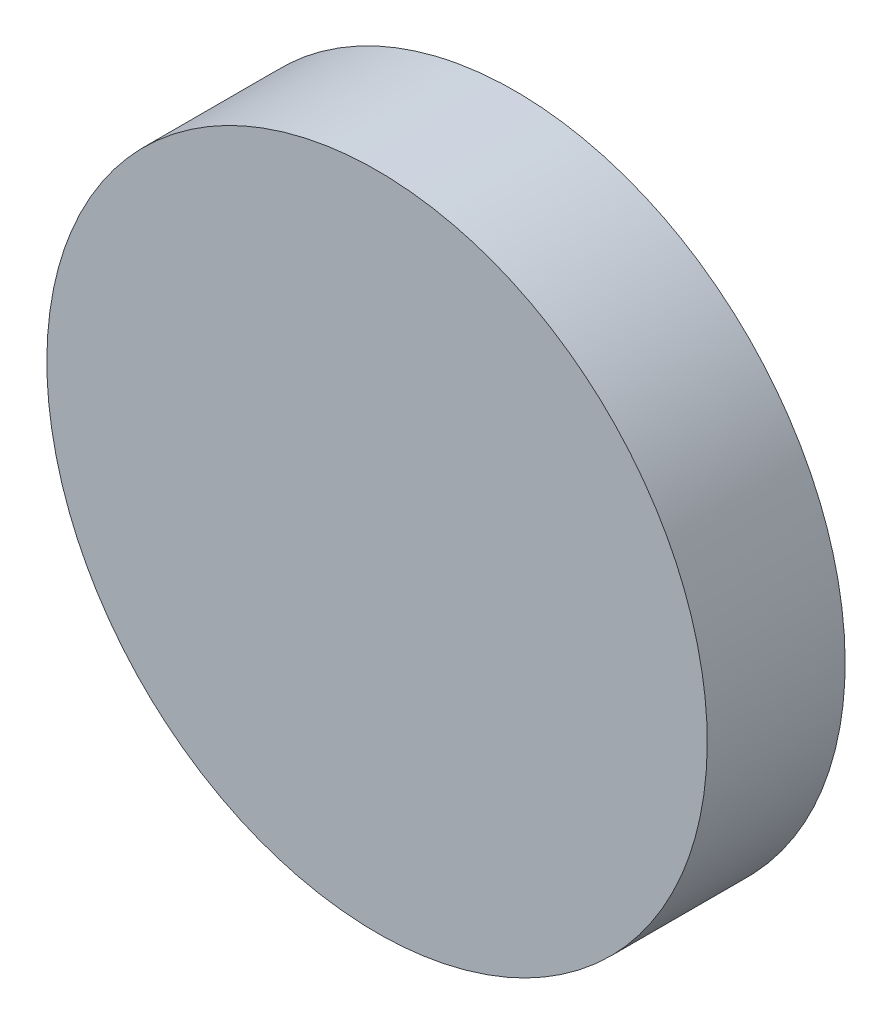
ISO-10303-21;
HEADER;
FILE_DESCRIPTION(('STEP AP214'),'2;1');
FILE_NAME('part.step','',(''),(''),'','','');
FILE_SCHEMA(('AUTOMOTIVE_DESIGN { 1 0 10303 214 1 1 1 1 }'));
ENDSEC;
DATA;
#1=APPLICATION_CONTEXT('core data for automotive mechanical design processes');
#2=APPLICATION_PROTOCOL_DEFINITION('international standard','automotive_design',2000,#1);
#3=PRODUCT_CONTEXT('',#1,'mechanical');
#4=PRODUCT('Part','Part','',(#3));
#5=PRODUCT_RELATED_PRODUCT_CATEGORY('part','',(#4));
#6=PRODUCT_DEFINITION_FORMATION('','',#4);
#7=PRODUCT_DEFINITION_CONTEXT('part definition',#1,'design');
#8=PRODUCT_DEFINITION('design','',#6,#7);
#9=PRODUCT_DEFINITION_SHAPE('','',#8);
#10=(LENGTH_UNIT() NAMED_UNIT(*) SI_UNIT(.MILLI.,.METRE.));
#11=(NAMED_UNIT(*) PLANE_ANGLE_UNIT() SI_UNIT($,.RADIAN.));
#12=(NAMED_UNIT(*) SI_UNIT($,.STERADIAN.) SOLID_ANGLE_UNIT());
#13=UNCERTAINTY_MEASURE_WITH_UNIT(LENGTH_MEASURE(1.E-05),#10,'distance_accuracy_value','');
#14=(GEOMETRIC_REPRESENTATION_CONTEXT(3) GLOBAL_UNCERTAINTY_ASSIGNED_CONTEXT((#13)) GLOBAL_UNIT_ASSIGNED_CONTEXT((#10,
#11,#12)) REPRESENTATION_CONTEXT('',''));
#15=CARTESIAN_POINT('',(0.,0.,0.));
#16=DIRECTION('',(0.,0.,1.));
#17=DIRECTION('',(1.,0.,0.));
#18=AXIS2_PLACEMENT_3D('',#15,#16,#17);
#19=CARTESIAN_POINT('',(4.40615937956644,-7.85,-7.2343687668426));
#20=CARTESIAN_POINT('',(4.40615937956644,-7.64139482578253,-7.2343687668426));
#21=CARTESIAN_POINT('',(4.48914767766892,-7.22418447734758,-7.2343687668426));
#22=CARTESIAN_POINT('',(4.84364369498715,-6.69364369498715,-7.2343687668426));
#23=CARTESIAN_POINT('',(5.37418447734758,-6.33914767766892,-7.2343687668426));
#24=CARTESIAN_POINT('',(6.,-6.21466523051519,-7.2343687668426));
#25=CARTESIAN_POINT('',(6.62581552265242,-6.33914767766892,-7.2343687668426));
#26=CARTESIAN_POINT('',(7.15635630501285,-6.69364369498715,-7.2343687668426));
#27=CARTESIAN_POINT('',(7.51085232233108,-7.22418447734758,-7.2343687668426));
#28=CARTESIAN_POINT('',(7.63533476948481,-7.85,-7.2343687668426));
#29=CARTESIAN_POINT('',(7.51085232233108,-8.47581552265242,-7.2343687668426));
#30=CARTESIAN_POINT('',(7.15635630501285,-9.00635630501285,-7.2343687668426));
#31=CARTESIAN_POINT('',(6.62581552265242,-9.36085232233108,-7.2343687668426));
#32=CARTESIAN_POINT('',(6.,-9.48533476948481,-7.2343687668426));
#33=CARTESIAN_POINT('',(5.37418447734758,-9.36085232233108,-7.2343687668426));
#34=CARTESIAN_POINT('',(4.84364369498715,-9.00635630501285,-7.2343687668426));
#35=CARTESIAN_POINT('',(4.48914767766892,-8.47581552265242,-7.2343687668426));
#36=CARTESIAN_POINT('',(4.40615937956644,-8.05860517421747,-7.2343687668426));
#37=CARTESIAN_POINT('',(4.40615937956644,-7.85,-7.2343687668426));
#38=B_SPLINE_CURVE_WITH_KNOTS('',3,(#19,#20,#21,#22,#23,#24,#25,#26,#27,#28,#29,#30,#31,#32,#33,
#34,#35,#36,#37),.UNSPECIFIED.,.T.,.F.,(4,1,1,1,1,1,1,1,1,1,1,1,1,1,1,1,4),(0.,0.0625,0.125,
0.1875,0.25,0.3125,0.375,0.4375,0.5,0.5625,0.625,0.6875,0.75,0.8125,0.875,0.9375,1.),.UNSPECIFIED.);
#39=DIRECTION('',(0.,0.,-1.));
#40=VECTOR('',#39,1.);
#41=SURFACE_OF_LINEAR_EXTRUSION('',#38,#40);
#42=CARTESIAN_POINT('',(4.40615937956644,-7.85,-7.2343687668426));
#43=CARTESIAN_POINT('',(4.40615937956644,-7.64139482578253,-7.2343687668426));
#44=CARTESIAN_POINT('',(4.48914767766892,-7.22418447734758,-7.2343687668426));
#45=CARTESIAN_POINT('',(4.84364369498715,-6.69364369498715,-7.2343687668426));
#46=CARTESIAN_POINT('',(5.37418447734758,-6.33914767766892,-7.2343687668426));
#47=CARTESIAN_POINT('',(6.,-6.21466523051519,-7.2343687668426));
#48=CARTESIAN_POINT('',(6.62581552265242,-6.33914767766892,-7.2343687668426));
#49=CARTESIAN_POINT('',(7.15635630501285,-6.69364369498715,-7.2343687668426));
#50=CARTESIAN_POINT('',(7.51085232233108,-7.22418447734758,-7.2343687668426));
#51=CARTESIAN_POINT('',(7.63533476948481,-7.85,-7.2343687668426));
#52=CARTESIAN_POINT('',(7.51085232233108,-8.47581552265242,-7.2343687668426));
#53=CARTESIAN_POINT('',(7.15635630501285,-9.00635630501285,-7.2343687668426));
#54=CARTESIAN_POINT('',(6.62581552265242,-9.36085232233108,-7.2343687668426));
#55=CARTESIAN_POINT('',(6.,-9.48533476948481,-7.2343687668426));
#56=CARTESIAN_POINT('',(5.37418447734758,-9.36085232233108,-7.2343687668426));
#57=CARTESIAN_POINT('',(4.84364369498715,-9.00635630501285,-7.2343687668426));
#58=CARTESIAN_POINT('',(4.48914767766892,-8.47581552265242,-7.2343687668426));
#59=CARTESIAN_POINT('',(4.40615937956644,-8.05860517421747,-7.2343687668426));
#60=CARTESIAN_POINT('',(4.40615937956644,-7.85,-7.2343687668426));
#61=B_SPLINE_CURVE_WITH_KNOTS('',3,(#42,#43,#44,#45,#46,#47,#48,#49,#50,#51,#52,#53,#54,#55,#56,
#57,#58,#59,#60),.UNSPECIFIED.,.T.,.F.,(4,1,1,1,1,1,1,1,1,1,1,1,1,1,1,1,4),(0.,0.0625,0.125,
0.1875,0.25,0.3125,0.375,0.4375,0.5,0.5625,0.625,0.6875,0.75,0.8125,0.875,0.9375,1.),.UNSPECIFIED.);
#62=CARTESIAN_POINT('',(4.40615937956644,-7.85,-7.2343687668426));
#63=VERTEX_POINT('',#62);
#64=EDGE_CURVE('E9',#63,#63,#61,.T.);
#65=ORIENTED_EDGE('',*,*,#64,.T.);
#66=EDGE_LOOP('',(#65));
#67=FACE_BOUND('',#66,.T.);
#68=CARTESIAN_POINT('',(4.40615937956644,-7.85,-7.9));
#69=CARTESIAN_POINT('',(4.40615936068841,-7.87607626205079,-7.9));
#70=CARTESIAN_POINT('',(4.40680775398327,-7.90215198285669,-7.9));
#71=CARTESIAN_POINT('',(4.40938881944497,-7.9542414022198,-7.9));
#72=CARTESIAN_POINT('',(4.41132156716732,-7.9802550970378,-7.9));
#73=CARTESIAN_POINT('',(4.41645896933017,-8.03215822267473,-7.9));
#74=CARTESIAN_POINT('',(4.41966371105239,-8.0580476448429,-7.9));
#75=CARTESIAN_POINT('',(4.42733277299065,-8.10964035851338,-7.9));
#76=CARTESIAN_POINT('',(4.43179714753067,-8.13534364193907,-7.9));
#77=CARTESIAN_POINT('',(4.44197319667312,-8.18650209986784,-7.9));
#78=CARTESIAN_POINT('',(4.44768487127555,-8.21195727437092,-7.9));
#79=CARTESIAN_POINT('',(4.46034326399522,-8.26255755947254,-7.9));
#80=CARTESIAN_POINT('',(4.46728992883248,-8.28770268339727,-7.9));
#81=CARTESIAN_POINT('',(4.48240603470013,-8.33762087734628,-7.9));
#82=CARTESIAN_POINT('',(4.49057539178457,-8.3623939727844,-7.9));
#83=CARTESIAN_POINT('',(4.50812462946405,-8.41150620297505,-7.9));
#84=CARTESIAN_POINT('',(4.51750443881648,-8.43584536317147,-7.9));
#85=CARTESIAN_POINT('',(4.5374621065762,-8.48402743536936,-7.9));
#86=CARTESIAN_POINT('',(4.5480399649835,-8.50787034737083,-7.9));
#87=CARTESIAN_POINT('',(4.57035837106943,-8.55500712338237,-7.9));
#88=CARTESIAN_POINT('',(4.58209898711576,-8.57830095500787,-7.9));
#89=CARTESIAN_POINT('',(4.606707779424,-8.62428714926546,-7.9));
#90=CARTESIAN_POINT('',(4.61957603301496,-8.64697947050907,-7.9));
#91=CARTESIAN_POINT('',(4.64640500305672,-8.69171011113872,-7.9));
#92=CARTESIAN_POINT('',(4.66036576660523,-8.71374840227321,-7.9));
#93=CARTESIAN_POINT('',(4.68934470335113,-8.75711844600313,-7.9));
#94=CARTESIAN_POINT('',(4.70436287654851,-8.77845019859857,-7.9));
#95=CARTESIAN_POINT('',(4.73542159756027,-8.82035460998663,-7.9));
#96=CARTESIAN_POINT('',(4.75146210125009,-8.84092730148047,-7.9));
#97=CARTESIAN_POINT('',(4.78453042779475,-8.8812610156734,-7.9));
#98=CARTESIAN_POINT('',(4.80155818281909,-8.90102209397652,-7.9));
#99=CARTESIAN_POINT('',(4.83656600116306,-8.93968007579376,-7.9));
#100=CARTESIAN_POINT('',(4.85454600840006,-8.95857703007835,-7.9));
#101=CARTESIAN_POINT('',(4.89142296992165,-8.99545399159994,-7.9));
#102=CARTESIAN_POINT('',(4.91031992420624,-9.01343399883694,-7.9));
#103=CARTESIAN_POINT('',(4.94897790602348,-9.04844181718091,-7.9));
#104=CARTESIAN_POINT('',(4.96873898432661,-9.06546957220525,-7.9));
#105=CARTESIAN_POINT('',(5.00907269851952,-9.09853789874991,-7.9));
#106=CARTESIAN_POINT('',(5.02964539001336,-9.11457840243973,-7.9));
#107=CARTESIAN_POINT('',(5.07154980140144,-9.14563712345149,-7.9));
#108=CARTESIAN_POINT('',(5.09288155399691,-9.16065529664887,-7.9));
#109=CARTESIAN_POINT('',(5.13625159772675,-9.18963423339477,-7.9));
#110=CARTESIAN_POINT('',(5.15828988886112,-9.20359499694329,-7.9));
#111=CARTESIAN_POINT('',(5.20302052949109,-9.23042396698503,-7.9));
#112=CARTESIAN_POINT('',(5.22571285073514,-9.24329222057596,-7.9));
#113=CARTESIAN_POINT('',(5.27169904499153,-9.26790101288428,-7.9));
#114=CARTESIAN_POINT('',(5.2949928766154,-9.27964162893071,-7.9));
#115=CARTESIAN_POINT('',(5.3421296526314,-9.30196003501637,-7.9));
#116=CARTESIAN_POINT('',(5.36597256463894,-9.3125378934233,-7.9));
#117=CARTESIAN_POINT('',(5.41415463682022,-9.33249556118402,-7.9));
#118=CARTESIAN_POINT('',(5.43849379699396,-9.34187537053782,-7.9));
#119=CARTESIAN_POINT('',(5.48760602724659,-9.35942460821356,-7.9));
#120=CARTESIAN_POINT('',(5.51237912276938,-9.36759396529288,-7.9));
#121=CARTESIAN_POINT('',(5.56229731648706,-9.38271007117451,-7.9));
#122=CARTESIAN_POINT('',(5.58744244009577,-9.38965673603087,-7.9));
#123=CARTESIAN_POINT('',(5.6380427260608,-9.40231512869838,-7.9));
#124=CARTESIAN_POINT('',(5.66349790174338,-9.40802680322955,-7.9));
#125=CARTESIAN_POINT('',(5.71465635644971,-9.41820285256667,-7.9));
#126=CARTESIAN_POINT('',(5.74035963547346,-9.42266722737262,-7.9));
#127=CARTESIAN_POINT('',(5.79195236117,-9.43033628858437,-7.9));
#128=CARTESIAN_POINT('',(5.81784179976527,-9.4335410293142,-7.9));
#129=CARTESIAN_POINT('',(5.86974488052374,-9.43867843418823,-7.9));
#130=CARTESIAN_POINT('',(5.89575851404153,-9.44061118561383,-7.9));
#131=CARTESIAN_POINT('',(5.94784810087706,-9.44319224095822,-7.9));
#132=CARTESIAN_POINT('',(5.97392405043853,-9.44384062043356,-7.9));
#133=CARTESIAN_POINT('',(6.02607594956148,-9.44384062043356,-7.9));
#134=CARTESIAN_POINT('',(6.05215189912295,-9.44319224095823,-7.9));
#135=CARTESIAN_POINT('',(6.10424148595847,-9.44061118561384,-7.9));
#136=CARTESIAN_POINT('',(6.13025511947626,-9.43867843418823,-7.9));
#137=CARTESIAN_POINT('',(6.18215820023473,-9.43354102931419,-7.9));
#138=CARTESIAN_POINT('',(6.20804763883,-9.43033628858437,-7.9));
#139=CARTESIAN_POINT('',(6.25964036452654,-9.42266722737262,-7.9));
#140=CARTESIAN_POINT('',(6.28534364355029,-9.41820285256667,-7.9));
#141=CARTESIAN_POINT('',(6.33650209825663,-9.40802680322955,-7.9));
#142=CARTESIAN_POINT('',(6.3619572739392,-9.40231512869838,-7.9));
#143=CARTESIAN_POINT('',(6.41255755990424,-9.38965673603087,-7.9));
#144=CARTESIAN_POINT('',(6.43770268351294,-9.38271007117451,-7.9));
#145=CARTESIAN_POINT('',(6.48762087723062,-9.36759396529288,-7.9));
#146=CARTESIAN_POINT('',(6.51239397275341,-9.35942460821356,-7.9));
#147=CARTESIAN_POINT('',(6.56150620300604,-9.34187537053782,-7.9));
#148=CARTESIAN_POINT('',(6.58584536317978,-9.33249556118402,-7.9));
#149=CARTESIAN_POINT('',(6.63402743536106,-9.3125378934233,-7.9));
#150=CARTESIAN_POINT('',(6.65787034736861,-9.30196003501637,-7.9));
#151=CARTESIAN_POINT('',(6.7050071233846,-9.27964162893071,-7.9));
#152=CARTESIAN_POINT('',(6.72830095500847,-9.26790101288428,-7.9));
#153=CARTESIAN_POINT('',(6.77428714926486,-9.24329222057596,-7.9));
#154=CARTESIAN_POINT('',(6.79697947050891,-9.23042396698503,-7.9));
#155=CARTESIAN_POINT('',(6.84171011113888,-9.20359499694329,-7.9));
#156=CARTESIAN_POINT('',(6.86374840227325,-9.18963423339477,-7.9));
#157=CARTESIAN_POINT('',(6.90711844600309,-9.16065529664887,-7.9));
#158=CARTESIAN_POINT('',(6.92845019859856,-9.14563712345149,-7.9));
#159=CARTESIAN_POINT('',(6.97035460998665,-9.11457840243973,-7.9));
#160=CARTESIAN_POINT('',(6.99092730148048,-9.09853789874991,-7.9));
#161=CARTESIAN_POINT('',(7.0312610156734,-9.06546957220525,-7.9));
#162=CARTESIAN_POINT('',(7.05102209397652,-9.04844181718091,-7.9));
#163=CARTESIAN_POINT('',(7.08968007579377,-9.01343399883694,-7.9));
#164=CARTESIAN_POINT('',(7.10857703007836,-8.99545399159994,-7.9));
#165=CARTESIAN_POINT('',(7.14545399159995,-8.95857703007835,-7.9));
#166=CARTESIAN_POINT('',(7.16343399883695,-8.93968007579376,-7.9));
#167=CARTESIAN_POINT('',(7.19844181718091,-8.90102209397652,-7.9));
#168=CARTESIAN_POINT('',(7.21546957220525,-8.8812610156734,-7.9));
#169=CARTESIAN_POINT('',(7.24853789874991,-8.84092730148048,-7.9));
#170=CARTESIAN_POINT('',(7.26457840243973,-8.82035460998664,-7.9));
#171=CARTESIAN_POINT('',(7.29563712345149,-8.77845019859856,-7.9));
#172=CARTESIAN_POINT('',(7.31065529664887,-8.75711844600309,-7.9));
#173=CARTESIAN_POINT('',(7.33963423339478,-8.71374840227325,-7.9));
#174=CARTESIAN_POINT('',(7.3535949969433,-8.69171011113888,-7.9));
#175=CARTESIAN_POINT('',(7.38042396698503,-8.64697947050891,-7.9));
#176=CARTESIAN_POINT('',(7.39329222057597,-8.62428714926486,-7.9));
#177=CARTESIAN_POINT('',(7.41790101288428,-8.57830095500847,-7.9));
#178=CARTESIAN_POINT('',(7.42964162893071,-8.5550071233846,-7.9));
#179=CARTESIAN_POINT('',(7.45196003501637,-8.5078703473686,-7.9));
#180=CARTESIAN_POINT('',(7.4625378934233,-8.48402743536106,-7.9));
#181=CARTESIAN_POINT('',(7.48249556118402,-8.43584536317978,-7.9));
#182=CARTESIAN_POINT('',(7.49187537053782,-8.41150620300604,-7.9));
#183=CARTESIAN_POINT('',(7.50942460821356,-8.36239397275341,-7.9));
#184=CARTESIAN_POINT('',(7.51759396529288,-8.33762087723062,-7.9));
#185=CARTESIAN_POINT('',(7.53271007117451,-8.28770268351294,-7.9));
#186=CARTESIAN_POINT('',(7.53965673603087,-8.26255755990423,-7.9));
#187=CARTESIAN_POINT('',(7.55231512869838,-8.2119572739392,-7.9));
#188=CARTESIAN_POINT('',(7.55802680322955,-8.18650209825662,-7.9));
#189=CARTESIAN_POINT('',(7.56820285256667,-8.13534364355029,-7.9));
#190=CARTESIAN_POINT('',(7.57266722737262,-8.10964036452654,-7.9));
#191=CARTESIAN_POINT('',(7.58033628858437,-8.05804763883,-7.9));
#192=CARTESIAN_POINT('',(7.58354102931419,-8.03215820023473,-7.9));
#193=CARTESIAN_POINT('',(7.58867843418823,-7.98025511947626,-7.9));
#194=CARTESIAN_POINT('',(7.59061118561384,-7.95424148595847,-7.9));
#195=CARTESIAN_POINT('',(7.59319224095823,-7.90215189912294,-7.9));
#196=CARTESIAN_POINT('',(7.59384062043357,-7.87607594956147,-7.9));
#197=CARTESIAN_POINT('',(7.59384062043357,-7.82392405043853,-7.9));
#198=CARTESIAN_POINT('',(7.59319224095823,-7.79784810087705,-7.9));
#199=CARTESIAN_POINT('',(7.59061118561384,-7.74575851404153,-7.9));
#200=CARTESIAN_POINT('',(7.58867843418823,-7.71974488052374,-7.9));
#201=CARTESIAN_POINT('',(7.5835410293142,-7.66784179976527,-7.9));
#202=CARTESIAN_POINT('',(7.58033628858437,-7.64195236117,-7.9));
#203=CARTESIAN_POINT('',(7.57266722737262,-7.59035963547346,-7.9));
#204=CARTESIAN_POINT('',(7.56820285256667,-7.5646563564497,-7.9));
#205=CARTESIAN_POINT('',(7.55802680322955,-7.51349790174337,-7.9));
#206=CARTESIAN_POINT('',(7.55231512869838,-7.4880427260608,-7.9));
#207=CARTESIAN_POINT('',(7.53965673603087,-7.43744244009577,-7.9));
#208=CARTESIAN_POINT('',(7.53271007117452,-7.41229731648706,-7.9));
#209=CARTESIAN_POINT('',(7.51759396529288,-7.36237912276938,-7.9));
#210=CARTESIAN_POINT('',(7.50942460821356,-7.33760602724659,-7.9));
#211=CARTESIAN_POINT('',(7.49187537053782,-7.28849379699396,-7.9));
#212=CARTESIAN_POINT('',(7.48249556118403,-7.26415463682022,-7.9));
#213=CARTESIAN_POINT('',(7.4625378934233,-7.21597256463894,-7.9));
#214=CARTESIAN_POINT('',(7.45196003501637,-7.1921296526314,-7.9));
#215=CARTESIAN_POINT('',(7.42964162893071,-7.1449928766154,-7.9));
#216=CARTESIAN_POINT('',(7.41790101288429,-7.12169904499153,-7.9));
#217=CARTESIAN_POINT('',(7.39329222057597,-7.07571285073514,-7.9));
#218=CARTESIAN_POINT('',(7.38042396698503,-7.05302052949109,-7.9));
#219=CARTESIAN_POINT('',(7.3535949969433,-7.00828988886112,-7.9));
#220=CARTESIAN_POINT('',(7.33963423339478,-6.98625159772675,-7.9));
#221=CARTESIAN_POINT('',(7.31065529664887,-6.94288155399691,-7.9));
#222=CARTESIAN_POINT('',(7.29563712345149,-6.92154980140144,-7.9));
#223=CARTESIAN_POINT('',(7.26457840243973,-6.87964539001336,-7.9));
#224=CARTESIAN_POINT('',(7.24853789874991,-6.85907269851952,-7.9));
#225=CARTESIAN_POINT('',(7.21546957220525,-6.8187389843266,-7.9));
#226=CARTESIAN_POINT('',(7.19844181718092,-6.79897790602348,-7.9));
#227=CARTESIAN_POINT('',(7.16343399883695,-6.76031992420624,-7.9));
#228=CARTESIAN_POINT('',(7.14545399159995,-6.74142296992165,-7.9));
#229=CARTESIAN_POINT('',(7.10857703007835,-6.70454600840006,-7.9));
#230=CARTESIAN_POINT('',(7.08968007579376,-6.68656600116305,-7.9));
#231=CARTESIAN_POINT('',(7.05102209397652,-6.65155818281909,-7.9));
#232=CARTESIAN_POINT('',(7.0312610156734,-6.63453042779475,-7.9));
#233=CARTESIAN_POINT('',(6.99092730148048,-6.60146210125009,-7.9));
#234=CARTESIAN_POINT('',(6.97035460998665,-6.58542159756027,-7.9));
#235=CARTESIAN_POINT('',(6.92845019859856,-6.55436287654851,-7.9));
#236=CARTESIAN_POINT('',(6.90711844600309,-6.53934470335113,-7.9));
#237=CARTESIAN_POINT('',(6.86374840227325,-6.51036576660522,-7.9));
#238=CARTESIAN_POINT('',(6.84171011113889,-6.4964050030567,-7.9));
#239=CARTESIAN_POINT('',(6.79697947050891,-6.46957603301497,-7.9));
#240=CARTESIAN_POINT('',(6.77428714926487,-6.45670777942403,-7.9));
#241=CARTESIAN_POINT('',(6.72830095500847,-6.43209898711572,-7.9));
#242=CARTESIAN_POINT('',(6.7050071233846,-6.42035837106929,-7.9));
#243=CARTESIAN_POINT('',(6.65787034736861,-6.39803996498363,-7.9));
#244=CARTESIAN_POINT('',(6.63402743536106,-6.3874621065767,-7.9));
#245=CARTESIAN_POINT('',(6.58584536317978,-6.36750443881597,-7.9));
#246=CARTESIAN_POINT('',(6.56150620300604,-6.35812462946218,-7.9));
#247=CARTESIAN_POINT('',(6.51239397275342,-6.34057539178644,-7.9));
#248=CARTESIAN_POINT('',(6.48762087723062,-6.33240603470712,-7.9));
#249=CARTESIAN_POINT('',(6.43770268351294,-6.31728992882549,-7.9));
#250=CARTESIAN_POINT('',(6.41255755990424,-6.31034326396914,-7.9));
#251=CARTESIAN_POINT('',(6.3619572739392,-6.29768487130162,-7.9));
#252=CARTESIAN_POINT('',(6.33650209825663,-6.29197319677045,-7.9));
#253=CARTESIAN_POINT('',(6.2853436435503,-6.28179714743333,-7.9));
#254=CARTESIAN_POINT('',(6.25964036452654,-6.27733277262738,-7.9));
#255=CARTESIAN_POINT('',(6.20804763883,-6.26966371141563,-7.9));
#256=CARTESIAN_POINT('',(6.18215820023473,-6.2664589706858,-7.9));
#257=CARTESIAN_POINT('',(6.13025511947626,-6.26132156581177,-7.9));
#258=CARTESIAN_POINT('',(6.10424148595847,-6.25938881438616,-7.9));
#259=CARTESIAN_POINT('',(6.05215189912295,-6.25680775904177,-7.9));
#260=CARTESIAN_POINT('',(6.02607594956148,-6.25615937956643,-7.9));
#261=CARTESIAN_POINT('',(5.97392405043853,-6.25615937956643,-7.9));
#262=CARTESIAN_POINT('',(5.94784810087706,-6.25680775904177,-7.9));
#263=CARTESIAN_POINT('',(5.89575851404153,-6.25938881438616,-7.9));
#264=CARTESIAN_POINT('',(5.86974488052375,-6.26132156581177,-7.9));
#265=CARTESIAN_POINT('',(5.81784179976527,-6.2664589706858,-7.9));
#266=CARTESIAN_POINT('',(5.79195236117,-6.26966371141563,-7.9));
#267=CARTESIAN_POINT('',(5.74035963547346,-6.27733277262738,-7.9));
#268=CARTESIAN_POINT('',(5.71465635644971,-6.28179714743333,-7.9));
#269=CARTESIAN_POINT('',(5.66349790174338,-6.29197319677045,-7.9));
#270=CARTESIAN_POINT('',(5.6380427260608,-6.29768487130162,-7.9));
#271=CARTESIAN_POINT('',(5.58744244009577,-6.31034326396914,-7.9));
#272=CARTESIAN_POINT('',(5.56229731648706,-6.31728992882549,-7.9));
#273=CARTESIAN_POINT('',(5.51237912276938,-6.33240603470712,-7.9));
#274=CARTESIAN_POINT('',(5.48760602724659,-6.34057539178644,-7.9));
#275=CARTESIAN_POINT('',(5.43849379699396,-6.35812462946218,-7.9));
#276=CARTESIAN_POINT('',(5.41415463682022,-6.36750443881597,-7.9));
#277=CARTESIAN_POINT('',(5.36597256463894,-6.3874621065767,-7.9));
#278=CARTESIAN_POINT('',(5.3421296526314,-6.39803996498363,-7.9));
#279=CARTESIAN_POINT('',(5.2949928766154,-6.42035837106929,-7.9));
#280=CARTESIAN_POINT('',(5.27169904499153,-6.43209898711572,-7.9));
#281=CARTESIAN_POINT('',(5.22571285073514,-6.45670777942403,-7.9));
#282=CARTESIAN_POINT('',(5.20302052949109,-6.46957603301497,-7.9));
#283=CARTESIAN_POINT('',(5.15828988886112,-6.4964050030567,-7.9));
#284=CARTESIAN_POINT('',(5.13625159772675,-6.51036576660522,-7.9));
#285=CARTESIAN_POINT('',(5.09288155399691,-6.53934470335113,-7.9));
#286=CARTESIAN_POINT('',(5.07154980140144,-6.55436287654851,-7.9));
#287=CARTESIAN_POINT('',(5.02964539001336,-6.58542159756027,-7.9));
#288=CARTESIAN_POINT('',(5.00907269851952,-6.60146210125009,-7.9));
#289=CARTESIAN_POINT('',(4.96873898432661,-6.63453042779475,-7.9));
#290=CARTESIAN_POINT('',(4.94897790602348,-6.65155818281909,-7.9));
#291=CARTESIAN_POINT('',(4.91031992420624,-6.68656600116305,-7.9));
#292=CARTESIAN_POINT('',(4.89142296992165,-6.70454600840005,-7.9));
#293=CARTESIAN_POINT('',(4.85454600840006,-6.74142296992165,-7.9));
#294=CARTESIAN_POINT('',(4.83656600116306,-6.76031992420624,-7.9));
#295=CARTESIAN_POINT('',(4.80155818281909,-6.79897790602348,-7.9));
#296=CARTESIAN_POINT('',(4.78453042779475,-6.8187389843266,-7.9));
#297=CARTESIAN_POINT('',(4.75146210125009,-6.85907269851953,-7.9));
#298=CARTESIAN_POINT('',(4.73542159756027,-6.87964539001337,-7.9));
#299=CARTESIAN_POINT('',(4.70436287654851,-6.92154980140143,-7.9));
#300=CARTESIAN_POINT('',(4.68934470335113,-6.94288155399687,-7.9));
#301=CARTESIAN_POINT('',(4.66036576660523,-6.98625159772679,-7.9));
#302=CARTESIAN_POINT('',(4.64640500305672,-7.00828988886128,-7.9));
#303=CARTESIAN_POINT('',(4.61957603301496,-7.05302052949093,-7.9));
#304=CARTESIAN_POINT('',(4.606707779424,-7.07571285073454,-7.9));
#305=CARTESIAN_POINT('',(4.58209898711576,-7.12169904499212,-7.9));
#306=CARTESIAN_POINT('',(4.57035837106943,-7.14499287661762,-7.9));
#307=CARTESIAN_POINT('',(4.5480399649835,-7.19212965262917,-7.9));
#308=CARTESIAN_POINT('',(4.5374621065762,-7.21597256463063,-7.9));
#309=CARTESIAN_POINT('',(4.51750443881648,-7.26415463682852,-7.9));
#310=CARTESIAN_POINT('',(4.50812462946405,-7.28849379702495,-7.9));
#311=CARTESIAN_POINT('',(4.49057539178457,-7.3376060272156,-7.9));
#312=CARTESIAN_POINT('',(4.48240603470013,-7.36237912265372,-7.9));
#313=CARTESIAN_POINT('',(4.46728992883248,-7.41229731660273,-7.9));
#314=CARTESIAN_POINT('',(4.46034326399522,-7.43744244052746,-7.9));
#315=CARTESIAN_POINT('',(4.44768487127555,-7.48804272562908,-7.9));
#316=CARTESIAN_POINT('',(4.44197319667312,-7.51349790013216,-7.9));
#317=CARTESIAN_POINT('',(4.43179714753067,-7.56465635806092,-7.9));
#318=CARTESIAN_POINT('',(4.42733277299065,-7.59035964148662,-7.9));
#319=CARTESIAN_POINT('',(4.41966371105239,-7.6419523551571,-7.9));
#320=CARTESIAN_POINT('',(4.41645896933017,-7.66784177732527,-7.9));
#321=CARTESIAN_POINT('',(4.41132156716732,-7.7197449029622,-7.9));
#322=CARTESIAN_POINT('',(4.40938881944497,-7.7457585977802,-7.9));
#323=CARTESIAN_POINT('',(4.40680775398327,-7.79784801714331,-7.9));
#324=CARTESIAN_POINT('',(4.40615936068841,-7.82392373794921,-7.9));
#325=CARTESIAN_POINT('',(4.40615937956644,-7.85,-7.9));
#326=B_SPLINE_CURVE_WITH_KNOTS('',3,(#68,#69,#70,#71,#72,#73,#74,#75,#76,#77,#78,#79,#80,#81,
#82,#83,#84,#85,#86,#87,#88,#89,#90,#91,#92,#93,#94,#95,#96,#97,#98,#99,#100,#101,#102,#103,
#104,#105,#106,#107,#108,#109,#110,#111,#112,#113,#114,#115,#116,#117,#118,#119,#120,#121,#122,
#123,#124,#125,#126,#127,#128,#129,#130,#131,#132,#133,#134,#135,#136,#137,#138,#139,#140,#141,
#142,#143,#144,#145,#146,#147,#148,#149,#150,#151,#152,#153,#154,#155,#156,#157,#158,#159,#160,
#161,#162,#163,#164,#165,#166,#167,#168,#169,#170,#171,#172,#173,#174,#175,#176,#177,#178,#179,
#180,#181,#182,#183,#184,#185,#186,#187,#188,#189,#190,#191,#192,#193,#194,#195,#196,#197,#198,
#199,#200,#201,#202,#203,#204,#205,#206,#207,#208,#209,#210,#211,#212,#213,#214,#215,#216,#217,
#218,#219,#220,#221,#222,#223,#224,#225,#226,#227,#228,#229,#230,#231,#232,#233,#234,#235,#236,
#237,#238,#239,#240,#241,#242,#243,#244,#245,#246,#247,#248,#249,#250,#251,#252,#253,#254,#255,
#256,#257,#258,#259,#260,#261,#262,#263,#264,#265,#266,#267,#268,#269,#270,#271,#272,#273,#274,
#275,#276,#277,#278,#279,#280,#281,#282,#283,#284,#285,#286,#287,#288,#289,#290,#291,#292,#293,
#294,#295,#296,#297,#298,#299,#300,#301,#302,#303,#304,#305,#306,#307,#308,#309,#310,#311,#312,
#313,#314,#315,#316,#317,#318,#319,#320,#321,#322,#323,#324,#325),.UNSPECIFIED.,.F.,.F.,(4,2,2,
2,2,2,2,2,2,2,2,2,2,2,2,2,2,2,2,2,2,2,2,2,2,2,2,2,2,2,2,2,2,2,2,2,2,2,2,2,2,2,2,2,2,2,2,2,2,2,2,
2,2,2,2,2,2,2,2,2,2,2,2,2,2,2,2,2,2,2,2,2,2,2,2,2,2,2,2,2,2,2,2,2,2,2,2,2,2,2,2,2,2,2,2,2,2,2,2,
2,2,2,2,2,2,2,2,2,2,2,2,2,2,2,2,2,2,2,2,2,2,2,2,2,2,2,2,2,4),(0.,0.0782199598708585,
0.156444521643892,0.234674451960651,0.312907756602051,0.391141061243452,0.469370991560211,
0.547595553333245,0.625815513204101,0.70403547307496,0.782260034847992,0.860489965164754,
0.938723269806154,1.01695657444755,1.09518650476431,1.17341106653735,1.25163102640821,
1.32985098627906,1.4080755480521,1.48630547836886,1.56453878301026,1.64277208765166,
1.72100201796842,1.79922657974145,1.87744653961231,1.95566649948317,2.0338910612562,
2.11212099157296,2.19035429621436,2.26858760085576,2.34681753117252,2.42504209294556,
2.50326205281641,2.58148201268727,2.65970657446031,2.73793650477707,2.81616980941847,
2.89440311405987,2.97263304437663,3.05085760614966,3.12907756602052,3.20729752589137,
3.28552208766441,3.36375201798117,3.44198532262257,3.52021862726397,3.59844855758073,
3.67667311935377,3.75489307922462,3.83311303909548,3.91133760086851,3.98956753118527,
4.06780083582667,4.14603414046807,4.22426407078483,4.30248863255787,4.38070859242873,
4.45892855229958,4.53715311407262,4.61538304438938,4.69361634903078,4.77184965367218,
4.85007958398894,4.92830414576197,5.00652410563283,5.08474406550369,5.16296862727672,
5.24119855759348,5.31943186223488,5.39766516687628,5.47589509719304,5.55411965896607,
5.63233961883693,5.71055957870779,5.78878414048082,5.86701407079758,5.94524737543898,
6.02348068008038,6.10171061039715,6.17993517217018,6.25815513204104,6.33637509191189,
6.41459965368493,6.49282958400169,6.57106288864309,6.64929619328449,6.72752612360125,
6.80575068537428,6.88397064524514,6.962190605116,7.04041516688903,7.11864509720579,
7.19687840184719,7.27511170648859,7.35334163680535,7.43156619857839,7.50978615844924,
7.5880061183201,7.66623068009313,7.7444606104099,7.82269391505129,7.90092721969269,
7.97915715000946,8.05738171178249,8.13560167165335,8.2138216315242,8.29204619329724,
8.370276123614,8.4485094282554,8.5267427328968,8.60497266321356,8.68319722498659,
8.76141718485745,8.83963714472831,8.91786170650134,8.9960916368181,9.0743249414595,
9.1525582461009,9.23078817641766,9.3090127381907,9.38723269806156,9.46545265793241,
9.54367721970545,9.6219071500222,9.70014045466361,9.778373759305,9.85660368962176,
9.9348282513948,10.0130482112657),.UNSPECIFIED.);
#327=CARTESIAN_POINT('',(4.40615937956644,-7.85,-7.9));
#328=VERTEX_POINT('',#327);
#329=EDGE_CURVE('E24',#328,#328,#326,.F.);
#330=ORIENTED_EDGE('',*,*,#329,.F.);
#331=EDGE_LOOP('',(#330));
#332=FACE_BOUND('',#331,.T.);
#333=ADVANCED_FACE('F14',(#67,#332),#41,.T.);
#334=CARTESIAN_POINT('',(-3.5,-7.85,-7.2343687668426));
#335=DIRECTION('',(0.,0.,-1.));
#336=DIRECTION('',(0.,1.,0.));
#337=AXIS2_PLACEMENT_3D('',#334,#335,#336);
#338=PLANE('',#337);
#339=ORIENTED_EDGE('',*,*,#64,.F.);
#340=EDGE_LOOP('',(#339));
#341=FACE_BOUND('',#340,.T.);
#342=ADVANCED_FACE('F62',(#341),#338,.F.);
#343=CARTESIAN_POINT('',(-3.5,-7.85,-7.9));
#344=DIRECTION('',(0.,0.,-1.));
#345=DIRECTION('',(0.,1.,0.));
#346=AXIS2_PLACEMENT_3D('',#343,#344,#345);
#347=PLANE('',#346);
#348=ORIENTED_EDGE('',*,*,#329,.T.);
#349=EDGE_LOOP('',(#348));
#350=FACE_BOUND('',#349,.T.);
#351=ADVANCED_FACE('F31',(#350),#347,.T.);
#352=CLOSED_SHELL('',(#333,#342,#351));
#353=MANIFOLD_SOLID_BREP('B1',#352);
#354=ADVANCED_BREP_SHAPE_REPRESENTATION('',(#18,#353),#14);
#355=SHAPE_DEFINITION_REPRESENTATION(#9,#354);
ENDSEC;
END-ISO-10303-21;
